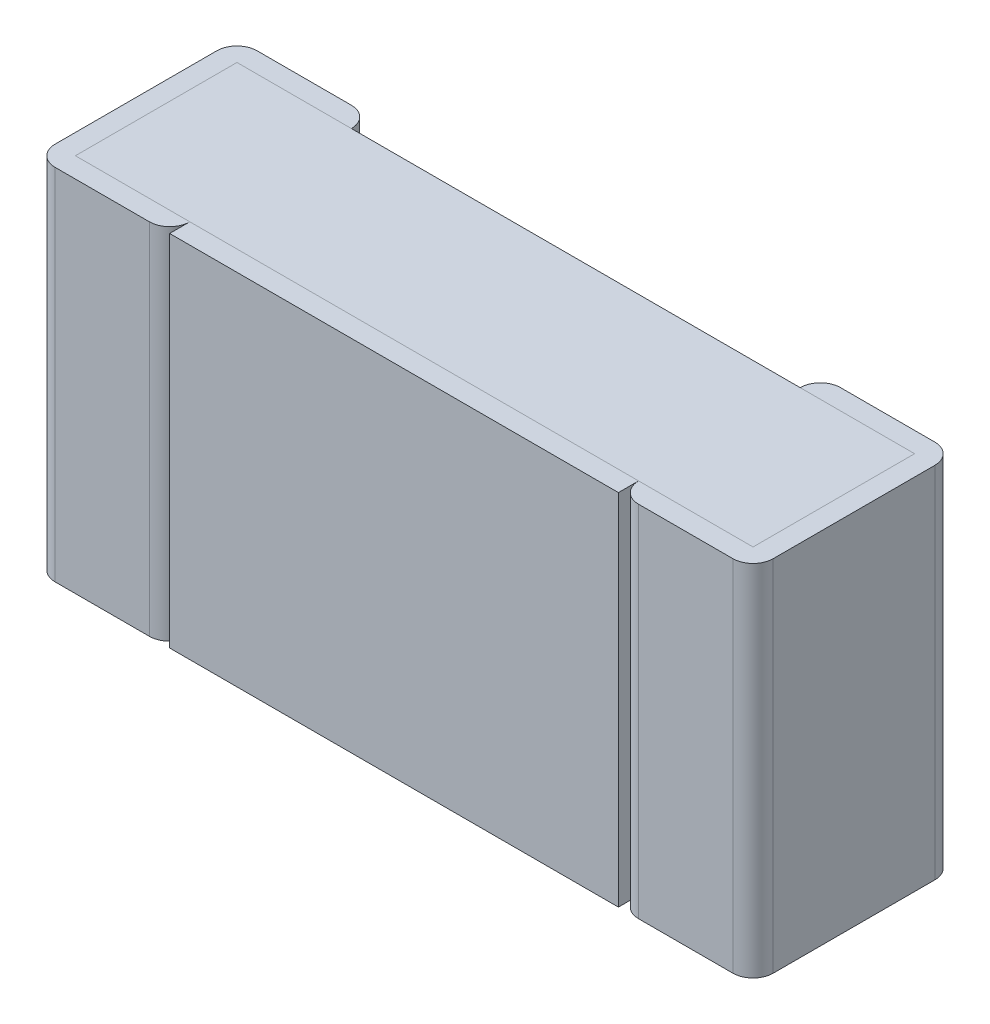
ISO-10303-21;
HEADER;
FILE_DESCRIPTION(('STEP AP214'),'2;1');
FILE_NAME('part.step','',(''),(''),'','','');
FILE_SCHEMA(('AUTOMOTIVE_DESIGN { 1 0 10303 214 1 1 1 1 }'));
ENDSEC;
DATA;
#1=APPLICATION_CONTEXT('core data for automotive mechanical design processes');
#2=APPLICATION_PROTOCOL_DEFINITION('international standard','automotive_design',2000,#1);
#3=PRODUCT_CONTEXT('',#1,'mechanical');
#4=PRODUCT('Part','Part','',(#3));
#5=PRODUCT_RELATED_PRODUCT_CATEGORY('part','',(#4));
#6=PRODUCT_DEFINITION_FORMATION('','',#4);
#7=PRODUCT_DEFINITION_CONTEXT('part definition',#1,'design');
#8=PRODUCT_DEFINITION('design','',#6,#7);
#9=PRODUCT_DEFINITION_SHAPE('','',#8);
#10=(LENGTH_UNIT() NAMED_UNIT(*) SI_UNIT(.MILLI.,.METRE.));
#11=(NAMED_UNIT(*) PLANE_ANGLE_UNIT() SI_UNIT($,.RADIAN.));
#12=(NAMED_UNIT(*) SI_UNIT($,.STERADIAN.) SOLID_ANGLE_UNIT());
#13=UNCERTAINTY_MEASURE_WITH_UNIT(LENGTH_MEASURE(1.E-05),#10,'distance_accuracy_value','');
#14=(GEOMETRIC_REPRESENTATION_CONTEXT(3) GLOBAL_UNCERTAINTY_ASSIGNED_CONTEXT((#13)) GLOBAL_UNIT_ASSIGNED_CONTEXT((#10,
#11,#12)) REPRESENTATION_CONTEXT('',''));
#15=CARTESIAN_POINT('',(0.,0.,0.));
#16=DIRECTION('',(0.,0.,1.));
#17=DIRECTION('',(1.,0.,0.));
#18=AXIS2_PLACEMENT_3D('',#15,#16,#17);
#19=CARTESIAN_POINT('',(171.210612279938,94.9615652923502,112.661582908599));
#20=DIRECTION('',(0.,0.,1.));
#21=DIRECTION('',(1.,0.,0.));
#22=AXIS2_PLACEMENT_3D('',#19,#20,#21);
#23=PLANE('',#22);
#24=DIRECTION('',(0.,1.,0.));
#25=VECTOR('',#24,1.);
#26=CARTESIAN_POINT('',(171.210612279938,94.9615652923502,112.661582908599));
#27=LINE('',#26,#25);
#28=CARTESIAN_POINT('',(171.210612279938,94.9615652923502,112.661582908599));
#29=VERTEX_POINT('',#28);
#30=CARTESIAN_POINT('',(171.210612279938,95.7615652923502,112.661582908599));
#31=VERTEX_POINT('',#30);
#32=EDGE_CURVE('E67',#29,#31,#27,.T.);
#33=ORIENTED_EDGE('',*,*,#32,.F.);
#34=DIRECTION('',(1.,0.,0.));
#35=VECTOR('',#34,1.);
#36=CARTESIAN_POINT('',(171.210612279938,94.9615652923502,112.661582908599));
#37=LINE('',#36,#35);
#38=CARTESIAN_POINT('',(172.210612279938,94.9615652923502,112.661582908599));
#39=VERTEX_POINT('',#38);
#40=EDGE_CURVE('E11',#29,#39,#37,.T.);
#41=ORIENTED_EDGE('',*,*,#40,.T.);
#42=DIRECTION('',(0.,1.,0.));
#43=VECTOR('',#42,1.);
#44=CARTESIAN_POINT('',(172.210612279938,94.9615652923502,112.661582908599));
#45=LINE('',#44,#43);
#46=CARTESIAN_POINT('',(172.210612279938,95.7615652923502,112.661582908599));
#47=VERTEX_POINT('',#46);
#48=EDGE_CURVE('E55',#39,#47,#45,.T.);
#49=ORIENTED_EDGE('',*,*,#48,.T.);
#50=DIRECTION('',(1.,0.,0.));
#51=VECTOR('',#50,1.);
#52=CARTESIAN_POINT('',(171.210612279938,95.7615652923502,112.661582908599));
#53=LINE('',#52,#51);
#54=EDGE_CURVE('E360',#31,#47,#53,.T.);
#55=ORIENTED_EDGE('',*,*,#54,.F.);
#56=EDGE_LOOP('',(#33,#41,#49,#55));
#57=FACE_BOUND('',#56,.T.);
#58=ADVANCED_FACE('F44',(#57),#23,.T.);
#59=CARTESIAN_POINT('',(172.210612279938,94.9615652923502,112.616582908599));
#60=DIRECTION('',(1.,0.,0.));
#61=DIRECTION('',(0.,1.,0.));
#62=AXIS2_PLACEMENT_3D('',#59,#60,#61);
#63=PLANE('',#62);
#64=DIRECTION('',(0.,0.,1.));
#65=VECTOR('',#64,1.);
#66=CARTESIAN_POINT('',(172.210612279938,94.9615652923502,112.616582908599));
#67=LINE('',#66,#65);
#68=CARTESIAN_POINT('',(172.210612279938,94.9615652923502,112.616582908599));
#69=VERTEX_POINT('',#68);
#70=EDGE_CURVE('E372',#69,#39,#67,.T.);
#71=ORIENTED_EDGE('',*,*,#70,.F.);
#72=DIRECTION('',(0.,1.,0.));
#73=VECTOR('',#72,1.);
#74=CARTESIAN_POINT('',(172.210612279938,94.9615652923502,112.616582908599));
#75=LINE('',#74,#73);
#76=CARTESIAN_POINT('',(172.210612279938,95.7615652923502,112.616582908599));
#77=VERTEX_POINT('',#76);
#78=EDGE_CURVE('E463',#69,#77,#75,.T.);
#79=ORIENTED_EDGE('',*,*,#78,.T.);
#80=DIRECTION('',(0.,0.,1.));
#81=VECTOR('',#80,1.);
#82=CARTESIAN_POINT('',(172.210612279938,95.7615652923502,112.616582908599));
#83=LINE('',#82,#81);
#84=EDGE_CURVE('E48',#77,#47,#83,.T.);
#85=ORIENTED_EDGE('',*,*,#84,.T.);
#86=ORIENTED_EDGE('',*,*,#48,.F.);
#87=EDGE_LOOP('',(#71,#79,#85,#86));
#88=FACE_BOUND('',#87,.T.);
#89=ADVANCED_FACE('F477',(#88),#63,.T.);
#90=CARTESIAN_POINT('',(172.255612279938,94.9615652923502,112.616582908599));
#91=DIRECTION('',(0.,1.,0.));
#92=DIRECTION('',(-1.,0.,0.));
#93=AXIS2_PLACEMENT_3D('',#90,#91,#92);
#94=CYLINDRICAL_SURFACE('',#93,0.0449999999999895);
#95=CARTESIAN_POINT('',(172.255612279938,94.9615652923502,112.616582908599));
#96=DIRECTION('',(0.,1.,0.));
#97=DIRECTION('',(0.,0.,1.));
#98=AXIS2_PLACEMENT_3D('',#95,#96,#97);
#99=CIRCLE('',#98,0.0450000000000034);
#100=CARTESIAN_POINT('',(172.255612279938,94.9615652923502,112.661582908599));
#101=VERTEX_POINT('',#100);
#102=EDGE_CURVE('E475',#69,#101,#99,.T.);
#103=ORIENTED_EDGE('',*,*,#102,.T.);
#104=DIRECTION('',(0.,1.,0.));
#105=VECTOR('',#104,1.);
#106=CARTESIAN_POINT('',(172.255612279938,94.9615652923502,112.661582908599));
#107=LINE('',#106,#105);
#108=CARTESIAN_POINT('',(172.255612279938,95.7615652923502,112.661582908599));
#109=VERTEX_POINT('',#108);
#110=EDGE_CURVE('E333',#101,#109,#107,.T.);
#111=ORIENTED_EDGE('',*,*,#110,.T.);
#112=CARTESIAN_POINT('',(172.255612279938,95.7615652923502,112.616582908599));
#113=DIRECTION('',(0.,1.,0.));
#114=DIRECTION('',(0.,0.,1.));
#115=AXIS2_PLACEMENT_3D('',#112,#113,#114);
#116=CIRCLE('',#115,0.0450000000000034);
#117=EDGE_CURVE('E459',#77,#109,#116,.T.);
#118=ORIENTED_EDGE('',*,*,#117,.F.);
#119=ORIENTED_EDGE('',*,*,#78,.F.);
#120=EDGE_LOOP('',(#103,#111,#118,#119));
#121=FACE_BOUND('',#120,.T.);
#122=ADVANCED_FACE('F461',(#121),#94,.T.);
#123=CARTESIAN_POINT('',(172.210612279938,94.9615652923502,112.661582908599));
#124=DIRECTION('',(0.,0.,1.));
#125=DIRECTION('',(1.,0.,0.));
#126=AXIS2_PLACEMENT_3D('',#123,#124,#125);
#127=PLANE('',#126);
#128=DIRECTION('',(1.,0.,0.));
#129=VECTOR('',#128,1.);
#130=CARTESIAN_POINT('',(172.210612279938,95.7615652923502,112.661582908599));
#131=LINE('',#130,#129);
#132=CARTESIAN_POINT('',(172.465612279938,95.7615652923502,112.661582908599));
#133=VERTEX_POINT('',#132);
#134=EDGE_CURVE('E469',#109,#133,#131,.T.);
#135=ORIENTED_EDGE('',*,*,#134,.F.);
#136=ORIENTED_EDGE('',*,*,#110,.F.);
#137=DIRECTION('',(1.,0.,0.));
#138=VECTOR('',#137,1.);
#139=CARTESIAN_POINT('',(172.210612279938,94.9615652923502,112.661582908599));
#140=LINE('',#139,#138);
#141=CARTESIAN_POINT('',(172.465612279938,94.9615652923502,112.661582908599));
#142=VERTEX_POINT('',#141);
#143=EDGE_CURVE('E285',#101,#142,#140,.T.);
#144=ORIENTED_EDGE('',*,*,#143,.T.);
#145=DIRECTION('',(0.,1.,0.));
#146=VECTOR('',#145,1.);
#147=CARTESIAN_POINT('',(172.465612279938,94.9615652923502,112.661582908599));
#148=LINE('',#147,#146);
#149=EDGE_CURVE('E282',#142,#133,#148,.T.);
#150=ORIENTED_EDGE('',*,*,#149,.T.);
#151=EDGE_LOOP('',(#135,#136,#144,#150));
#152=FACE_BOUND('',#151,.T.);
#153=ADVANCED_FACE('F536',(#152),#127,.T.);
#154=CARTESIAN_POINT('',(172.465612279938,94.9615652923502,112.616582908599));
#155=DIRECTION('',(0.,1.,0.));
#156=DIRECTION('',(1.,0.,0.));
#157=AXIS2_PLACEMENT_3D('',#154,#155,#156);
#158=CYLINDRICAL_SURFACE('',#157,0.0449999999999895);
#159=DIRECTION('',(0.,1.,0.));
#160=VECTOR('',#159,1.);
#161=CARTESIAN_POINT('',(172.510612279938,94.9615652923502,112.616582908599));
#162=LINE('',#161,#160);
#163=CARTESIAN_POINT('',(172.510612279938,94.9615652923502,112.616582908599));
#164=VERTEX_POINT('',#163);
#165=CARTESIAN_POINT('',(172.510612279938,95.7615652923502,112.616582908599));
#166=VERTEX_POINT('',#165);
#167=EDGE_CURVE('E286',#164,#166,#162,.T.);
#168=ORIENTED_EDGE('',*,*,#167,.T.);
#169=CARTESIAN_POINT('',(172.465612279938,95.7615652923502,112.616582908599));
#170=DIRECTION('',(0.,-1.,0.));
#171=DIRECTION('',(0.,0.,1.));
#172=AXIS2_PLACEMENT_3D('',#169,#170,#171);
#173=CIRCLE('',#172,0.0450000000000034);
#174=EDGE_CURVE('E291',#166,#133,#173,.T.);
#175=ORIENTED_EDGE('',*,*,#174,.T.);
#176=ORIENTED_EDGE('',*,*,#149,.F.);
#177=CARTESIAN_POINT('',(172.465612279938,94.9615652923502,112.616582908599));
#178=DIRECTION('',(0.,-1.,0.));
#179=DIRECTION('',(0.,0.,1.));
#180=AXIS2_PLACEMENT_3D('',#177,#178,#179);
#181=CIRCLE('',#180,0.0450000000000034);
#182=EDGE_CURVE('E310',#164,#142,#181,.T.);
#183=ORIENTED_EDGE('',*,*,#182,.F.);
#184=EDGE_LOOP('',(#168,#175,#176,#183));
#185=FACE_BOUND('',#184,.T.);
#186=ADVANCED_FACE('F598',(#185),#158,.T.);
#187=CARTESIAN_POINT('',(172.510612279938,94.9615652923502,112.211582908599));
#188=DIRECTION('',(1.,0.,0.));
#189=DIRECTION('',(0.,1.,0.));
#190=AXIS2_PLACEMENT_3D('',#187,#188,#189);
#191=PLANE('',#190);
#192=DIRECTION('',(0.,0.,1.));
#193=VECTOR('',#192,1.);
#194=CARTESIAN_POINT('',(172.510612279938,94.9615652923502,112.211582908599));
#195=LINE('',#194,#193);
#196=CARTESIAN_POINT('',(172.510612279938,94.9615652923502,112.256582908599));
#197=VERTEX_POINT('',#196);
#198=EDGE_CURVE('E305',#197,#164,#195,.T.);
#199=ORIENTED_EDGE('',*,*,#198,.F.);
#200=DIRECTION('',(0.,1.,0.));
#201=VECTOR('',#200,1.);
#202=CARTESIAN_POINT('',(172.510612279938,94.9615652923502,112.256582908599));
#203=LINE('',#202,#201);
#204=CARTESIAN_POINT('',(172.510612279938,95.7615652923502,112.256582908599));
#205=VERTEX_POINT('',#204);
#206=EDGE_CURVE('E287',#197,#205,#203,.T.);
#207=ORIENTED_EDGE('',*,*,#206,.T.);
#208=DIRECTION('',(0.,0.,1.));
#209=VECTOR('',#208,1.);
#210=CARTESIAN_POINT('',(172.510612279938,95.7615652923502,112.211582908599));
#211=LINE('',#210,#209);
#212=EDGE_CURVE('E292',#205,#166,#211,.T.);
#213=ORIENTED_EDGE('',*,*,#212,.T.);
#214=ORIENTED_EDGE('',*,*,#167,.F.);
#215=EDGE_LOOP('',(#199,#207,#213,#214));
#216=FACE_BOUND('',#215,.T.);
#217=ADVANCED_FACE('F595',(#216),#191,.T.);
#218=CARTESIAN_POINT('',(172.465612279938,94.9615652923502,112.256582908599));
#219=DIRECTION('',(0.,1.,0.));
#220=DIRECTION('',(1.,0.,0.));
#221=AXIS2_PLACEMENT_3D('',#218,#219,#220);
#222=CYLINDRICAL_SURFACE('',#221,0.0449999999999895);
#223=CARTESIAN_POINT('',(172.465612279938,94.9615652923502,112.256582908599));
#224=DIRECTION('',(0.,1.,0.));
#225=DIRECTION('',(0.,0.,1.));
#226=AXIS2_PLACEMENT_3D('',#223,#224,#225);
#227=CIRCLE('',#226,0.0450000000000034);
#228=CARTESIAN_POINT('',(172.465612279938,94.9615652923502,112.211582908599));
#229=VERTEX_POINT('',#228);
#230=EDGE_CURVE('E345',#197,#229,#227,.T.);
#231=ORIENTED_EDGE('',*,*,#230,.T.);
#232=DIRECTION('',(0.,1.,0.));
#233=VECTOR('',#232,1.);
#234=CARTESIAN_POINT('',(172.465612279938,94.9615652923502,112.211582908599));
#235=LINE('',#234,#233);
#236=CARTESIAN_POINT('',(172.465612279938,95.7615652923502,112.211582908599));
#237=VERTEX_POINT('',#236);
#238=EDGE_CURVE('E349',#229,#237,#235,.T.);
#239=ORIENTED_EDGE('',*,*,#238,.T.);
#240=CARTESIAN_POINT('',(172.465612279938,95.7615652923502,112.256582908599));
#241=DIRECTION('',(0.,1.,0.));
#242=DIRECTION('',(0.,0.,1.));
#243=AXIS2_PLACEMENT_3D('',#240,#241,#242);
#244=CIRCLE('',#243,0.0450000000000034);
#245=EDGE_CURVE('E518',#205,#237,#244,.T.);
#246=ORIENTED_EDGE('',*,*,#245,.F.);
#247=ORIENTED_EDGE('',*,*,#206,.F.);
#248=EDGE_LOOP('',(#231,#239,#246,#247));
#249=FACE_BOUND('',#248,.T.);
#250=ADVANCED_FACE('F558',(#249),#222,.T.);
#251=CARTESIAN_POINT('',(172.210612279938,94.9615652923502,112.211582908599));
#252=DIRECTION('',(0.,0.,1.));
#253=DIRECTION('',(1.,0.,0.));
#254=AXIS2_PLACEMENT_3D('',#251,#252,#253);
#255=PLANE('',#254);
#256=ORIENTED_EDGE('',*,*,#238,.F.);
#257=DIRECTION('',(1.,0.,0.));
#258=VECTOR('',#257,1.);
#259=CARTESIAN_POINT('',(172.210612279938,94.9615652923502,112.211582908599));
#260=LINE('',#259,#258);
#261=CARTESIAN_POINT('',(172.255612279938,94.9615652923502,112.211582908599));
#262=VERTEX_POINT('',#261);
#263=EDGE_CURVE('E400',#262,#229,#260,.T.);
#264=ORIENTED_EDGE('',*,*,#263,.F.);
#265=DIRECTION('',(0.,1.,0.));
#266=VECTOR('',#265,1.);
#267=CARTESIAN_POINT('',(172.255612279938,94.9615652923502,112.211582908599));
#268=LINE('',#267,#266);
#269=CARTESIAN_POINT('',(172.255612279938,95.7615652923502,112.211582908599));
#270=VERTEX_POINT('',#269);
#271=EDGE_CURVE('E325',#262,#270,#268,.T.);
#272=ORIENTED_EDGE('',*,*,#271,.T.);
#273=DIRECTION('',(1.,0.,0.));
#274=VECTOR('',#273,1.);
#275=CARTESIAN_POINT('',(172.210612279938,95.7615652923502,112.211582908599));
#276=LINE('',#275,#274);
#277=EDGE_CURVE('E321',#270,#237,#276,.T.);
#278=ORIENTED_EDGE('',*,*,#277,.T.);
#279=EDGE_LOOP('',(#256,#264,#272,#278));
#280=FACE_BOUND('',#279,.T.);
#281=ADVANCED_FACE('F46',(#280),#255,.F.);
#282=CARTESIAN_POINT('',(172.255612279938,94.9615652923502,112.256582908599));
#283=DIRECTION('',(0.,1.,0.));
#284=DIRECTION('',(-1.,0.,0.));
#285=AXIS2_PLACEMENT_3D('',#282,#283,#284);
#286=CYLINDRICAL_SURFACE('',#285,0.0449999999999895);
#287=DIRECTION('',(0.,1.,0.));
#288=VECTOR('',#287,1.);
#289=CARTESIAN_POINT('',(172.210612279938,94.9615652923502,112.256582908599));
#290=LINE('',#289,#288);
#291=CARTESIAN_POINT('',(172.210612279938,94.9615652923502,112.256582908599));
#292=VERTEX_POINT('',#291);
#293=CARTESIAN_POINT('',(172.210612279938,95.7615652923502,112.256582908599));
#294=VERTEX_POINT('',#293);
#295=EDGE_CURVE('E315',#292,#294,#290,.T.);
#296=ORIENTED_EDGE('',*,*,#295,.T.);
#297=CARTESIAN_POINT('',(172.255612279938,95.7615652923502,112.256582908599));
#298=DIRECTION('',(0.,-1.,0.));
#299=DIRECTION('',(0.,0.,1.));
#300=AXIS2_PLACEMENT_3D('',#297,#298,#299);
#301=CIRCLE('',#300,0.0450000000000034);
#302=EDGE_CURVE('E311',#294,#270,#301,.T.);
#303=ORIENTED_EDGE('',*,*,#302,.T.);
#304=ORIENTED_EDGE('',*,*,#271,.F.);
#305=CARTESIAN_POINT('',(172.255612279938,94.9615652923502,112.256582908599));
#306=DIRECTION('',(0.,-1.,0.));
#307=DIRECTION('',(0.,0.,1.));
#308=AXIS2_PLACEMENT_3D('',#305,#306,#307);
#309=CIRCLE('',#308,0.0450000000000034);
#310=EDGE_CURVE('E319',#292,#262,#309,.T.);
#311=ORIENTED_EDGE('',*,*,#310,.F.);
#312=EDGE_LOOP('',(#296,#303,#304,#311));
#313=FACE_BOUND('',#312,.T.);
#314=ADVANCED_FACE('F553',(#313),#286,.T.);
#315=CARTESIAN_POINT('',(171.210612279938,95.7615652923502,112.616582908599));
#316=DIRECTION('',(0.,1.,0.));
#317=DIRECTION('',(1.,0.,0.));
#318=AXIS2_PLACEMENT_3D('',#315,#316,#317);
#319=PLANE('',#318);
#320=DIRECTION('',(1.,0.,0.));
#321=VECTOR('',#320,1.);
#322=CARTESIAN_POINT('',(171.210612279938,95.7615652923502,112.616582908599));
#323=LINE('',#322,#321);
#324=CARTESIAN_POINT('',(171.210612279938,95.7615652923502,112.616582908599));
#325=VERTEX_POINT('',#324);
#326=EDGE_CURVE('E354',#325,#77,#323,.T.);
#327=ORIENTED_EDGE('',*,*,#326,.F.);
#328=DIRECTION('',(0.,0.,1.));
#329=VECTOR('',#328,1.);
#330=CARTESIAN_POINT('',(171.210612279938,95.7615652923502,112.616582908599));
#331=LINE('',#330,#329);
#332=EDGE_CURVE('E316',#325,#31,#331,.T.);
#333=ORIENTED_EDGE('',*,*,#332,.T.);
#334=ORIENTED_EDGE('',*,*,#54,.T.);
#335=ORIENTED_EDGE('',*,*,#84,.F.);
#336=EDGE_LOOP('',(#327,#333,#334,#335));
#337=FACE_BOUND('',#336,.T.);
#338=ADVANCED_FACE('F472',(#337),#319,.T.);
#339=CARTESIAN_POINT('',(172.210612279938,95.7615652923502,112.211582908599));
#340=DIRECTION('',(0.,1.,0.));
#341=DIRECTION('',(1.,0.,0.));
#342=AXIS2_PLACEMENT_3D('',#339,#340,#341);
#343=PLANE('',#342);
#344=ORIENTED_EDGE('',*,*,#277,.F.);
#345=ORIENTED_EDGE('',*,*,#302,.F.);
#346=DIRECTION('',(1.,0.,0.));
#347=VECTOR('',#346,1.);
#348=CARTESIAN_POINT('',(170.955612279938,95.7615652923502,112.256582908599));
#349=LINE('',#348,#347);
#350=CARTESIAN_POINT('',(172.465612279938,95.7615652923502,112.256582908599));
#351=VERTEX_POINT('',#350);
#352=EDGE_CURVE('E363',#294,#351,#349,.T.);
#353=ORIENTED_EDGE('',*,*,#352,.T.);
#354=DIRECTION('',(0.,0.,1.));
#355=VECTOR('',#354,1.);
#356=CARTESIAN_POINT('',(172.465612279938,95.7615652923502,112.256582908599));
#357=LINE('',#356,#355);
#358=CARTESIAN_POINT('',(172.465612279938,95.7615652923502,112.616582908599));
#359=VERTEX_POINT('',#358);
#360=EDGE_CURVE('E468',#351,#359,#357,.T.);
#361=ORIENTED_EDGE('',*,*,#360,.T.);
#362=DIRECTION('',(1.,0.,0.));
#363=VECTOR('',#362,1.);
#364=CARTESIAN_POINT('',(170.955612279938,95.7615652923502,112.616582908599));
#365=LINE('',#364,#363);
#366=EDGE_CURVE('E350',#77,#359,#365,.T.);
#367=ORIENTED_EDGE('',*,*,#366,.F.);
#368=ORIENTED_EDGE('',*,*,#117,.T.);
#369=ORIENTED_EDGE('',*,*,#134,.T.);
#370=ORIENTED_EDGE('',*,*,#174,.F.);
#371=ORIENTED_EDGE('',*,*,#212,.F.);
#372=ORIENTED_EDGE('',*,*,#245,.T.);
#373=EDGE_LOOP('',(#344,#345,#353,#361,#367,#368,#369,#370,#371,#372));
#374=FACE_BOUND('',#373,.T.);
#375=ADVANCED_FACE('F482',(#374),#343,.T.);
#376=CARTESIAN_POINT('',(171.210612279938,94.9615652923502,112.616582908599));
#377=DIRECTION('',(1.,0.,0.));
#378=DIRECTION('',(0.,1.,0.));
#379=AXIS2_PLACEMENT_3D('',#376,#377,#378);
#380=PLANE('',#379);
#381=ORIENTED_EDGE('',*,*,#32,.T.);
#382=ORIENTED_EDGE('',*,*,#332,.F.);
#383=DIRECTION('',(0.,1.,0.));
#384=VECTOR('',#383,1.);
#385=CARTESIAN_POINT('',(171.210612279938,94.9615652923502,112.616582908599));
#386=LINE('',#385,#384);
#387=CARTESIAN_POINT('',(171.210612279938,94.9615652923502,112.616582908599));
#388=VERTEX_POINT('',#387);
#389=EDGE_CURVE('E280',#388,#325,#386,.T.);
#390=ORIENTED_EDGE('',*,*,#389,.F.);
#391=DIRECTION('',(0.,0.,1.));
#392=VECTOR('',#391,1.);
#393=CARTESIAN_POINT('',(171.210612279938,94.9615652923502,112.616582908599));
#394=LINE('',#393,#392);
#395=EDGE_CURVE('E368',#388,#29,#394,.T.);
#396=ORIENTED_EDGE('',*,*,#395,.T.);
#397=EDGE_LOOP('',(#381,#382,#390,#396));
#398=FACE_BOUND('',#397,.T.);
#399=ADVANCED_FACE('F580',(#398),#380,.F.);
#400=CARTESIAN_POINT('',(171.210612279938,94.9615652923502,112.616582908599));
#401=DIRECTION('',(0.,1.,0.));
#402=DIRECTION('',(1.,0.,0.));
#403=AXIS2_PLACEMENT_3D('',#400,#401,#402);
#404=PLANE('',#403);
#405=ORIENTED_EDGE('',*,*,#70,.T.);
#406=ORIENTED_EDGE('',*,*,#40,.F.);
#407=ORIENTED_EDGE('',*,*,#395,.F.);
#408=DIRECTION('',(1.,0.,0.));
#409=VECTOR('',#408,1.);
#410=CARTESIAN_POINT('',(171.210612279938,94.9615652923502,112.616582908599));
#411=LINE('',#410,#409);
#412=EDGE_CURVE('E309',#388,#69,#411,.T.);
#413=ORIENTED_EDGE('',*,*,#412,.T.);
#414=EDGE_LOOP('',(#405,#406,#407,#413));
#415=FACE_BOUND('',#414,.T.);
#416=ADVANCED_FACE('F527',(#415),#404,.F.);
#417=CARTESIAN_POINT('',(172.210612279938,94.9615652923502,112.211582908599));
#418=DIRECTION('',(0.,1.,0.));
#419=DIRECTION('',(1.,0.,0.));
#420=AXIS2_PLACEMENT_3D('',#417,#418,#419);
#421=PLANE('',#420);
#422=ORIENTED_EDGE('',*,*,#230,.F.);
#423=ORIENTED_EDGE('',*,*,#198,.T.);
#424=ORIENTED_EDGE('',*,*,#182,.T.);
#425=ORIENTED_EDGE('',*,*,#143,.F.);
#426=ORIENTED_EDGE('',*,*,#102,.F.);
#427=DIRECTION('',(1.,0.,0.));
#428=VECTOR('',#427,1.);
#429=CARTESIAN_POINT('',(170.955612279938,94.9615652923502,112.616582908599));
#430=LINE('',#429,#428);
#431=CARTESIAN_POINT('',(172.465612279938,94.9615652923502,112.616582908599));
#432=VERTEX_POINT('',#431);
#433=EDGE_CURVE('E317',#69,#432,#430,.T.);
#434=ORIENTED_EDGE('',*,*,#433,.T.);
#435=DIRECTION('',(0.,0.,1.));
#436=VECTOR('',#435,1.);
#437=CARTESIAN_POINT('',(172.465612279938,94.9615652923502,112.256582908599));
#438=LINE('',#437,#436);
#439=CARTESIAN_POINT('',(172.465612279938,94.9615652923502,112.256582908599));
#440=VERTEX_POINT('',#439);
#441=EDGE_CURVE('E299',#440,#432,#438,.T.);
#442=ORIENTED_EDGE('',*,*,#441,.F.);
#443=DIRECTION('',(1.,0.,0.));
#444=VECTOR('',#443,1.);
#445=CARTESIAN_POINT('',(170.955612279938,94.9615652923502,112.256582908599));
#446=LINE('',#445,#444);
#447=EDGE_CURVE('E304',#292,#440,#446,.T.);
#448=ORIENTED_EDGE('',*,*,#447,.F.);
#449=ORIENTED_EDGE('',*,*,#310,.T.);
#450=ORIENTED_EDGE('',*,*,#263,.T.);
#451=EDGE_LOOP('',(#422,#423,#424,#425,#426,#434,#442,#448,#449,#450));
#452=FACE_BOUND('',#451,.T.);
#453=ADVANCED_FACE('F532',(#452),#421,.F.);
#454=CARTESIAN_POINT('',(170.955612279938,94.9615652923502,112.256582908599));
#455=DIRECTION('',(0.,0.,1.));
#456=DIRECTION('',(1.,0.,0.));
#457=AXIS2_PLACEMENT_3D('',#454,#455,#456);
#458=PLANE('',#457);
#459=DIRECTION('',(1.,0.,0.));
#460=VECTOR('',#459,1.);
#461=CARTESIAN_POINT('',(170.955612279938,95.7615652923502,112.256582908599));
#462=LINE('',#461,#460);
#463=CARTESIAN_POINT('',(171.210612279938,95.7615652923502,112.256582908599));
#464=VERTEX_POINT('',#463);
#465=EDGE_CURVE('E408',#464,#294,#462,.T.);
#466=ORIENTED_EDGE('',*,*,#465,.T.);
#467=ORIENTED_EDGE('',*,*,#295,.F.);
#468=DIRECTION('',(1.,0.,0.));
#469=VECTOR('',#468,1.);
#470=CARTESIAN_POINT('',(170.955612279938,94.9615652923502,112.256582908599));
#471=LINE('',#470,#469);
#472=CARTESIAN_POINT('',(171.210612279938,94.9615652923502,112.256582908599));
#473=VERTEX_POINT('',#472);
#474=EDGE_CURVE('E376',#473,#292,#471,.T.);
#475=ORIENTED_EDGE('',*,*,#474,.F.);
#476=DIRECTION('',(0.,1.,0.));
#477=VECTOR('',#476,1.);
#478=CARTESIAN_POINT('',(171.210612279938,94.9615652923502,112.256582908599));
#479=LINE('',#478,#477);
#480=EDGE_CURVE('E391',#473,#464,#479,.T.);
#481=ORIENTED_EDGE('',*,*,#480,.T.);
#482=EDGE_LOOP('',(#466,#467,#475,#481));
#483=FACE_BOUND('',#482,.T.);
#484=ADVANCED_FACE('F561',(#483),#458,.F.);
#485=CARTESIAN_POINT('',(170.955612279938,95.7615652923502,112.256582908599));
#486=DIRECTION('',(0.,1.,0.));
#487=DIRECTION('',(1.,0.,0.));
#488=AXIS2_PLACEMENT_3D('',#485,#486,#487);
#489=PLANE('',#488);
#490=DIRECTION('',(1.,0.,0.));
#491=VECTOR('',#490,1.);
#492=CARTESIAN_POINT('',(170.955612279938,95.7615652923502,112.256582908599));
#493=LINE('',#492,#491);
#494=CARTESIAN_POINT('',(170.955612279938,95.7615652923502,112.256582908599));
#495=VERTEX_POINT('',#494);
#496=EDGE_CURVE('E367',#495,#464,#493,.T.);
#497=ORIENTED_EDGE('',*,*,#496,.F.);
#498=DIRECTION('',(0.,0.,1.));
#499=VECTOR('',#498,1.);
#500=CARTESIAN_POINT('',(170.955612279938,95.7615652923502,112.256582908599));
#501=LINE('',#500,#499);
#502=CARTESIAN_POINT('',(170.955612279938,95.7615652923502,112.616582908599));
#503=VERTEX_POINT('',#502);
#504=EDGE_CURVE('E381',#495,#503,#501,.T.);
#505=ORIENTED_EDGE('',*,*,#504,.T.);
#506=DIRECTION('',(1.,0.,0.));
#507=VECTOR('',#506,1.);
#508=CARTESIAN_POINT('',(170.955612279938,95.7615652923502,112.616582908599));
#509=LINE('',#508,#507);
#510=EDGE_CURVE('E377',#503,#325,#509,.T.);
#511=ORIENTED_EDGE('',*,*,#510,.T.);
#512=ORIENTED_EDGE('',*,*,#326,.T.);
#513=ORIENTED_EDGE('',*,*,#366,.T.);
#514=ORIENTED_EDGE('',*,*,#360,.F.);
#515=ORIENTED_EDGE('',*,*,#352,.F.);
#516=ORIENTED_EDGE('',*,*,#465,.F.);
#517=EDGE_LOOP('',(#497,#505,#511,#512,#513,#514,#515,#516));
#518=FACE_BOUND('',#517,.T.);
#519=ADVANCED_FACE('F448',(#518),#489,.T.);
#520=CARTESIAN_POINT('',(171.165612279938,94.9615652923502,112.616582908599));
#521=DIRECTION('',(0.,1.,0.));
#522=DIRECTION('',(1.,0.,0.));
#523=AXIS2_PLACEMENT_3D('',#520,#521,#522);
#524=CYLINDRICAL_SURFACE('',#523,0.0449999999999895);
#525=ORIENTED_EDGE('',*,*,#389,.T.);
#526=CARTESIAN_POINT('',(171.165612279938,95.7615652923502,112.616582908599));
#527=DIRECTION('',(0.,-1.,0.));
#528=DIRECTION('',(0.,0.,1.));
#529=AXIS2_PLACEMENT_3D('',#526,#527,#528);
#530=CIRCLE('',#529,0.0450000000000034);
#531=CARTESIAN_POINT('',(171.165612279938,95.7615652923502,112.661582908599));
#532=VERTEX_POINT('',#531);
#533=EDGE_CURVE('E326',#325,#532,#530,.T.);
#534=ORIENTED_EDGE('',*,*,#533,.T.);
#535=DIRECTION('',(0.,1.,0.));
#536=VECTOR('',#535,1.);
#537=CARTESIAN_POINT('',(171.165612279938,94.9615652923502,112.661582908599));
#538=LINE('',#537,#536);
#539=CARTESIAN_POINT('',(171.165612279938,94.9615652923502,112.661582908599));
#540=VERTEX_POINT('',#539);
#541=EDGE_CURVE('E424',#540,#532,#538,.T.);
#542=ORIENTED_EDGE('',*,*,#541,.F.);
#543=CARTESIAN_POINT('',(171.165612279938,94.9615652923502,112.616582908599));
#544=DIRECTION('',(0.,-1.,0.));
#545=DIRECTION('',(0.,0.,1.));
#546=AXIS2_PLACEMENT_3D('',#543,#544,#545);
#547=CIRCLE('',#546,0.0450000000000034);
#548=EDGE_CURVE('E338',#388,#540,#547,.T.);
#549=ORIENTED_EDGE('',*,*,#548,.F.);
#550=EDGE_LOOP('',(#525,#534,#542,#549));
#551=FACE_BOUND('',#550,.T.);
#552=ADVANCED_FACE('F576',(#551),#524,.T.);
#553=CARTESIAN_POINT('',(170.910612279938,94.9615652923502,112.661582908599));
#554=DIRECTION('',(0.,0.,1.));
#555=DIRECTION('',(1.,0.,0.));
#556=AXIS2_PLACEMENT_3D('',#553,#554,#555);
#557=PLANE('',#556);
#558=DIRECTION('',(1.,0.,0.));
#559=VECTOR('',#558,1.);
#560=CARTESIAN_POINT('',(170.910612279938,95.7615652923502,112.661582908599));
#561=LINE('',#560,#559);
#562=CARTESIAN_POINT('',(170.955612279938,95.7615652923502,112.661582908599));
#563=VERTEX_POINT('',#562);
#564=EDGE_CURVE('E359',#563,#532,#561,.T.);
#565=ORIENTED_EDGE('',*,*,#564,.F.);
#566=DIRECTION('',(0.,1.,0.));
#567=VECTOR('',#566,1.);
#568=CARTESIAN_POINT('',(170.955612279938,94.9615652923502,112.661582908599));
#569=LINE('',#568,#567);
#570=CARTESIAN_POINT('',(170.955612279938,94.9615652923502,112.661582908599));
#571=VERTEX_POINT('',#570);
#572=EDGE_CURVE('E272',#571,#563,#569,.T.);
#573=ORIENTED_EDGE('',*,*,#572,.F.);
#574=DIRECTION('',(1.,0.,0.));
#575=VECTOR('',#574,1.);
#576=CARTESIAN_POINT('',(170.910612279938,94.9615652923502,112.661582908599));
#577=LINE('',#576,#575);
#578=EDGE_CURVE('E330',#571,#540,#577,.T.);
#579=ORIENTED_EDGE('',*,*,#578,.T.);
#580=ORIENTED_EDGE('',*,*,#541,.T.);
#581=EDGE_LOOP('',(#565,#573,#579,#580));
#582=FACE_BOUND('',#581,.T.);
#583=ADVANCED_FACE('F422',(#582),#557,.T.);
#584=CARTESIAN_POINT('',(170.955612279938,94.9615652923502,112.256582908599));
#585=DIRECTION('',(0.,1.,0.));
#586=DIRECTION('',(1.,0.,0.));
#587=AXIS2_PLACEMENT_3D('',#584,#585,#586);
#588=PLANE('',#587);
#589=ORIENTED_EDGE('',*,*,#474,.T.);
#590=ORIENTED_EDGE('',*,*,#447,.T.);
#591=ORIENTED_EDGE('',*,*,#441,.T.);
#592=ORIENTED_EDGE('',*,*,#433,.F.);
#593=ORIENTED_EDGE('',*,*,#412,.F.);
#594=DIRECTION('',(1.,0.,0.));
#595=VECTOR('',#594,1.);
#596=CARTESIAN_POINT('',(170.955612279938,94.9615652923502,112.616582908599));
#597=LINE('',#596,#595);
#598=CARTESIAN_POINT('',(170.955612279938,94.9615652923502,112.616582908599));
#599=VERTEX_POINT('',#598);
#600=EDGE_CURVE('E276',#599,#388,#597,.T.);
#601=ORIENTED_EDGE('',*,*,#600,.F.);
#602=DIRECTION('',(0.,0.,1.));
#603=VECTOR('',#602,1.);
#604=CARTESIAN_POINT('',(170.955612279938,94.9615652923502,112.256582908599));
#605=LINE('',#604,#603);
#606=CARTESIAN_POINT('',(170.955612279938,94.9615652923502,112.256582908599));
#607=VERTEX_POINT('',#606);
#608=EDGE_CURVE('E266',#607,#599,#605,.T.);
#609=ORIENTED_EDGE('',*,*,#608,.F.);
#610=DIRECTION('',(1.,0.,0.));
#611=VECTOR('',#610,1.);
#612=CARTESIAN_POINT('',(170.955612279938,94.9615652923502,112.256582908599));
#613=LINE('',#612,#611);
#614=EDGE_CURVE('E296',#607,#473,#613,.T.);
#615=ORIENTED_EDGE('',*,*,#614,.T.);
#616=EDGE_LOOP('',(#589,#590,#591,#592,#593,#601,#609,#615));
#617=FACE_BOUND('',#616,.T.);
#618=ADVANCED_FACE('F529',(#617),#588,.F.);
#619=CARTESIAN_POINT('',(171.165612279938,94.9615652923502,112.256582908599));
#620=DIRECTION('',(0.,1.,0.));
#621=DIRECTION('',(1.,0.,0.));
#622=AXIS2_PLACEMENT_3D('',#619,#620,#621);
#623=CYLINDRICAL_SURFACE('',#622,0.0449999999999895);
#624=CARTESIAN_POINT('',(171.165612279938,94.9615652923502,112.256582908599));
#625=DIRECTION('',(0.,1.,0.));
#626=DIRECTION('',(0.,0.,1.));
#627=AXIS2_PLACEMENT_3D('',#624,#625,#626);
#628=CIRCLE('',#627,0.0450000000000034);
#629=CARTESIAN_POINT('',(171.165612279938,94.9615652923502,112.211582908599));
#630=VERTEX_POINT('',#629);
#631=EDGE_CURVE('E300',#473,#630,#628,.T.);
#632=ORIENTED_EDGE('',*,*,#631,.T.);
#633=DIRECTION('',(0.,1.,0.));
#634=VECTOR('',#633,1.);
#635=CARTESIAN_POINT('',(171.165612279938,94.9615652923502,112.211582908599));
#636=LINE('',#635,#634);
#637=CARTESIAN_POINT('',(171.165612279938,95.7615652923502,112.211582908599));
#638=VERTEX_POINT('',#637);
#639=EDGE_CURVE('E259',#630,#638,#636,.T.);
#640=ORIENTED_EDGE('',*,*,#639,.T.);
#641=CARTESIAN_POINT('',(171.165612279938,95.7615652923502,112.256582908599));
#642=DIRECTION('',(0.,1.,0.));
#643=DIRECTION('',(0.,0.,1.));
#644=AXIS2_PLACEMENT_3D('',#641,#642,#643);
#645=CIRCLE('',#644,0.0450000000000034);
#646=EDGE_CURVE('E245',#464,#638,#645,.T.);
#647=ORIENTED_EDGE('',*,*,#646,.F.);
#648=ORIENTED_EDGE('',*,*,#480,.F.);
#649=EDGE_LOOP('',(#632,#640,#647,#648));
#650=FACE_BOUND('',#649,.T.);
#651=ADVANCED_FACE('F567',(#650),#623,.T.);
#652=CARTESIAN_POINT('',(170.910612279938,94.9615652923502,112.211582908599));
#653=DIRECTION('',(0.,0.,1.));
#654=DIRECTION('',(1.,0.,0.));
#655=AXIS2_PLACEMENT_3D('',#652,#653,#654);
#656=PLANE('',#655);
#657=ORIENTED_EDGE('',*,*,#639,.F.);
#658=DIRECTION('',(1.,0.,0.));
#659=VECTOR('',#658,1.);
#660=CARTESIAN_POINT('',(170.910612279938,94.9615652923502,112.211582908599));
#661=LINE('',#660,#659);
#662=CARTESIAN_POINT('',(170.955612279938,94.9615652923502,112.211582908599));
#663=VERTEX_POINT('',#662);
#664=EDGE_CURVE('E255',#663,#630,#661,.T.);
#665=ORIENTED_EDGE('',*,*,#664,.F.);
#666=DIRECTION('',(0.,1.,0.));
#667=VECTOR('',#666,1.);
#668=CARTESIAN_POINT('',(170.955612279938,94.9615652923502,112.211582908599));
#669=LINE('',#668,#667);
#670=CARTESIAN_POINT('',(170.955612279938,95.7615652923502,112.211582908599));
#671=VERTEX_POINT('',#670);
#672=EDGE_CURVE('E249',#663,#671,#669,.T.);
#673=ORIENTED_EDGE('',*,*,#672,.T.);
#674=DIRECTION('',(1.,0.,0.));
#675=VECTOR('',#674,1.);
#676=CARTESIAN_POINT('',(170.910612279938,95.7615652923502,112.211582908599));
#677=LINE('',#676,#675);
#678=EDGE_CURVE('E237',#671,#638,#677,.T.);
#679=ORIENTED_EDGE('',*,*,#678,.T.);
#680=EDGE_LOOP('',(#657,#665,#673,#679));
#681=FACE_BOUND('',#680,.T.);
#682=ADVANCED_FACE('F253',(#681),#656,.F.);
#683=CARTESIAN_POINT('',(170.910612279938,95.7615652923502,112.211582908599));
#684=DIRECTION('',(0.,1.,0.));
#685=DIRECTION('',(1.,0.,0.));
#686=AXIS2_PLACEMENT_3D('',#683,#684,#685);
#687=PLANE('',#686);
#688=ORIENTED_EDGE('',*,*,#678,.F.);
#689=CARTESIAN_POINT('',(170.955612279938,95.7615652923502,112.256582908599));
#690=DIRECTION('',(0.,-1.,0.));
#691=DIRECTION('',(0.,0.,1.));
#692=AXIS2_PLACEMENT_3D('',#689,#690,#691);
#693=CIRCLE('',#692,0.0450000000000034);
#694=CARTESIAN_POINT('',(170.910612279938,95.7615652923502,112.256582908599));
#695=VERTEX_POINT('',#694);
#696=EDGE_CURVE('E242',#695,#671,#693,.T.);
#697=ORIENTED_EDGE('',*,*,#696,.F.);
#698=DIRECTION('',(0.,0.,1.));
#699=VECTOR('',#698,1.);
#700=CARTESIAN_POINT('',(170.910612279938,95.7615652923502,112.211582908599));
#701=LINE('',#700,#699);
#702=CARTESIAN_POINT('',(170.910612279938,95.7615652923502,112.616582908599));
#703=VERTEX_POINT('',#702);
#704=EDGE_CURVE('E250',#695,#703,#701,.T.);
#705=ORIENTED_EDGE('',*,*,#704,.T.);
#706=CARTESIAN_POINT('',(170.955612279938,95.7615652923502,112.616582908599));
#707=DIRECTION('',(0.,1.,0.));
#708=DIRECTION('',(0.,0.,1.));
#709=AXIS2_PLACEMENT_3D('',#706,#707,#708);
#710=CIRCLE('',#709,0.0450000000000034);
#711=EDGE_CURVE('E355',#703,#563,#710,.T.);
#712=ORIENTED_EDGE('',*,*,#711,.T.);
#713=ORIENTED_EDGE('',*,*,#564,.T.);
#714=ORIENTED_EDGE('',*,*,#533,.F.);
#715=ORIENTED_EDGE('',*,*,#510,.F.);
#716=ORIENTED_EDGE('',*,*,#504,.F.);
#717=ORIENTED_EDGE('',*,*,#496,.T.);
#718=ORIENTED_EDGE('',*,*,#646,.T.);
#719=EDGE_LOOP('',(#688,#697,#705,#712,#713,#714,#715,#716,#717,#718));
#720=FACE_BOUND('',#719,.T.);
#721=ADVANCED_FACE('F239',(#720),#687,.T.);
#722=CARTESIAN_POINT('',(170.955612279938,94.9615652923502,112.616582908599));
#723=DIRECTION('',(0.,1.,0.));
#724=DIRECTION('',(-1.,0.,0.));
#725=AXIS2_PLACEMENT_3D('',#722,#723,#724);
#726=CYLINDRICAL_SURFACE('',#725,0.0449999999999895);
#727=CARTESIAN_POINT('',(170.955612279938,94.9615652923502,112.616582908599));
#728=DIRECTION('',(0.,1.,0.));
#729=DIRECTION('',(0.,0.,1.));
#730=AXIS2_PLACEMENT_3D('',#727,#728,#729);
#731=CIRCLE('',#730,0.0450000000000034);
#732=CARTESIAN_POINT('',(170.910612279938,94.9615652923502,112.616582908599));
#733=VERTEX_POINT('',#732);
#734=EDGE_CURVE('E409',#733,#571,#731,.T.);
#735=ORIENTED_EDGE('',*,*,#734,.T.);
#736=ORIENTED_EDGE('',*,*,#572,.T.);
#737=ORIENTED_EDGE('',*,*,#711,.F.);
#738=DIRECTION('',(0.,1.,0.));
#739=VECTOR('',#738,1.);
#740=CARTESIAN_POINT('',(170.910612279938,94.9615652923502,112.616582908599));
#741=LINE('',#740,#739);
#742=EDGE_CURVE('E384',#733,#703,#741,.T.);
#743=ORIENTED_EDGE('',*,*,#742,.F.);
#744=EDGE_LOOP('',(#735,#736,#737,#743));
#745=FACE_BOUND('',#744,.T.);
#746=ADVANCED_FACE('F417',(#745),#726,.T.);
#747=CARTESIAN_POINT('',(170.955612279938,94.9615652923502,112.256582908599));
#748=DIRECTION('',(0.,1.,0.));
#749=DIRECTION('',(-1.,0.,0.));
#750=AXIS2_PLACEMENT_3D('',#747,#748,#749);
#751=CYLINDRICAL_SURFACE('',#750,0.0449999999999895);
#752=DIRECTION('',(0.,1.,0.));
#753=VECTOR('',#752,1.);
#754=CARTESIAN_POINT('',(170.910612279938,94.9615652923502,112.256582908599));
#755=LINE('',#754,#753);
#756=CARTESIAN_POINT('',(170.910612279938,94.9615652923502,112.256582908599));
#757=VERTEX_POINT('',#756);
#758=EDGE_CURVE('E264',#757,#695,#755,.T.);
#759=ORIENTED_EDGE('',*,*,#758,.T.);
#760=ORIENTED_EDGE('',*,*,#696,.T.);
#761=ORIENTED_EDGE('',*,*,#672,.F.);
#762=CARTESIAN_POINT('',(170.955612279938,94.9615652923502,112.256582908599));
#763=DIRECTION('',(0.,-1.,0.));
#764=DIRECTION('',(0.,0.,1.));
#765=AXIS2_PLACEMENT_3D('',#762,#763,#764);
#766=CIRCLE('',#765,0.0450000000000034);
#767=EDGE_CURVE('E344',#757,#663,#766,.T.);
#768=ORIENTED_EDGE('',*,*,#767,.F.);
#769=EDGE_LOOP('',(#759,#760,#761,#768));
#770=FACE_BOUND('',#769,.T.);
#771=ADVANCED_FACE('F262',(#770),#751,.T.);
#772=CARTESIAN_POINT('',(170.910612279938,94.9615652923502,112.211582908599));
#773=DIRECTION('',(0.,1.,0.));
#774=DIRECTION('',(1.,0.,0.));
#775=AXIS2_PLACEMENT_3D('',#772,#773,#774);
#776=PLANE('',#775);
#777=ORIENTED_EDGE('',*,*,#631,.F.);
#778=ORIENTED_EDGE('',*,*,#614,.F.);
#779=ORIENTED_EDGE('',*,*,#608,.T.);
#780=ORIENTED_EDGE('',*,*,#600,.T.);
#781=ORIENTED_EDGE('',*,*,#548,.T.);
#782=ORIENTED_EDGE('',*,*,#578,.F.);
#783=ORIENTED_EDGE('',*,*,#734,.F.);
#784=DIRECTION('',(0.,0.,1.));
#785=VECTOR('',#784,1.);
#786=CARTESIAN_POINT('',(170.910612279938,94.9615652923502,112.211582908599));
#787=LINE('',#786,#785);
#788=EDGE_CURVE('E388',#757,#733,#787,.T.);
#789=ORIENTED_EDGE('',*,*,#788,.F.);
#790=ORIENTED_EDGE('',*,*,#767,.T.);
#791=ORIENTED_EDGE('',*,*,#664,.T.);
#792=EDGE_LOOP('',(#777,#778,#779,#780,#781,#782,#783,#789,#790,#791));
#793=FACE_BOUND('',#792,.T.);
#794=ADVANCED_FACE('F434',(#793),#776,.F.);
#795=CARTESIAN_POINT('',(170.910612279938,94.9615652923502,112.211582908599));
#796=DIRECTION('',(1.,0.,0.));
#797=DIRECTION('',(0.,1.,0.));
#798=AXIS2_PLACEMENT_3D('',#795,#796,#797);
#799=PLANE('',#798);
#800=ORIENTED_EDGE('',*,*,#742,.T.);
#801=ORIENTED_EDGE('',*,*,#704,.F.);
#802=ORIENTED_EDGE('',*,*,#758,.F.);
#803=ORIENTED_EDGE('',*,*,#788,.T.);
#804=EDGE_LOOP('',(#800,#801,#802,#803));
#805=FACE_BOUND('',#804,.T.);
#806=ADVANCED_FACE('F430',(#805),#799,.F.);
#807=CLOSED_SHELL('',(#58,#89,#122,#153,#186,#217,#250,#281,#314,#338,#375,#399,#416,#453,#484,
#519,#552,#583,#618,#651,#682,#721,#746,#771,#794,#806));
#808=MANIFOLD_SOLID_BREP('B2',#807);
#809=ADVANCED_BREP_SHAPE_REPRESENTATION('',(#18,#808),#14);
#810=SHAPE_DEFINITION_REPRESENTATION(#9,#809);
ENDSEC;
END-ISO-10303-21;
